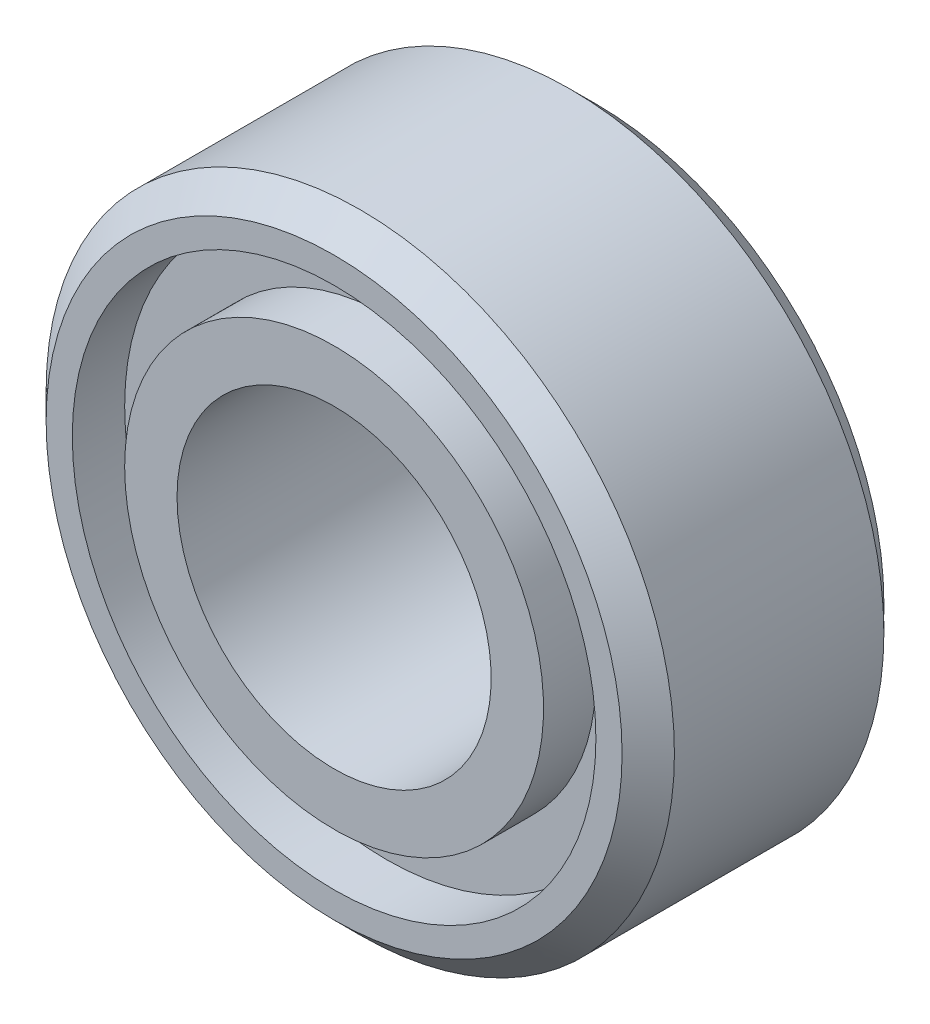
ISO-10303-21;
HEADER;
FILE_DESCRIPTION(('STEP AP214'),'2;1');
FILE_NAME('part.step','',(''),(''),'','','');
FILE_SCHEMA(('AUTOMOTIVE_DESIGN { 1 0 10303 214 1 1 1 1 }'));
ENDSEC;
DATA;
#1=APPLICATION_CONTEXT('core data for automotive mechanical design processes');
#2=APPLICATION_PROTOCOL_DEFINITION('international standard','automotive_design',2000,#1);
#3=PRODUCT_CONTEXT('',#1,'mechanical');
#4=PRODUCT('Part','Part','',(#3));
#5=PRODUCT_RELATED_PRODUCT_CATEGORY('part','',(#4));
#6=PRODUCT_DEFINITION_FORMATION('','',#4);
#7=PRODUCT_DEFINITION_CONTEXT('part definition',#1,'design');
#8=PRODUCT_DEFINITION('design','',#6,#7);
#9=PRODUCT_DEFINITION_SHAPE('','',#8);
#10=(LENGTH_UNIT() NAMED_UNIT(*) SI_UNIT(.MILLI.,.METRE.));
#11=(NAMED_UNIT(*) PLANE_ANGLE_UNIT() SI_UNIT($,.RADIAN.));
#12=(NAMED_UNIT(*) SI_UNIT($,.STERADIAN.) SOLID_ANGLE_UNIT());
#13=UNCERTAINTY_MEASURE_WITH_UNIT(LENGTH_MEASURE(1.E-05),#10,'distance_accuracy_value','');
#14=(GEOMETRIC_REPRESENTATION_CONTEXT(3) GLOBAL_UNCERTAINTY_ASSIGNED_CONTEXT((#13)) GLOBAL_UNIT_ASSIGNED_CONTEXT((#10,
#11,#12)) REPRESENTATION_CONTEXT('',''));
#15=CARTESIAN_POINT('',(0.,0.,0.));
#16=DIRECTION('',(0.,0.,1.));
#17=DIRECTION('',(1.,0.,0.));
#18=AXIS2_PLACEMENT_3D('',#15,#16,#17);
#19=CARTESIAN_POINT('',(0.,0.,2.5));
#20=DIRECTION('',(0.,0.,-1.));
#21=DIRECTION('',(-1.,0.,0.));
#22=AXIS2_PLACEMENT_3D('',#19,#20,#21);
#23=CYLINDRICAL_SURFACE('',#22,3.);
#24=CARTESIAN_POINT('',(0.,0.,-0.250000000000001));
#25=DIRECTION('',(0.,0.,-1.));
#26=DIRECTION('',(-1.,0.,0.));
#27=AXIS2_PLACEMENT_3D('',#24,#25,#26);
#28=CIRCLE('',#27,3.);
#29=CARTESIAN_POINT('',(-3.,0.,-0.250000000000001));
#30=VERTEX_POINT('',#29);
#31=EDGE_CURVE('E10',#30,#30,#28,.T.);
#32=ORIENTED_EDGE('',*,*,#31,.T.);
#33=EDGE_LOOP('',(#32));
#34=FACE_BOUND('',#33,.T.);
#35=CARTESIAN_POINT('',(0.,0.,-2.25));
#36=DIRECTION('',(0.,0.,-1.));
#37=DIRECTION('',(-1.,0.,0.));
#38=AXIS2_PLACEMENT_3D('',#35,#36,#37);
#39=CIRCLE('',#38,3.);
#40=CARTESIAN_POINT('',(-3.,0.,-2.25));
#41=VERTEX_POINT('',#40);
#42=EDGE_CURVE('E96',#41,#41,#39,.T.);
#43=ORIENTED_EDGE('',*,*,#42,.F.);
#44=EDGE_LOOP('',(#43));
#45=FACE_BOUND('',#44,.T.);
#46=ADVANCED_FACE('F37',(#34,#45),#23,.T.);
#47=CARTESIAN_POINT('',(0.,0.,-0.250000000000001));
#48=DIRECTION('',(0.,0.,-1.));
#49=DIRECTION('',(-1.,0.,0.));
#50=AXIS2_PLACEMENT_3D('',#47,#48,#49);
#51=CONICAL_SURFACE('',#50,3.,0.785398163397454);
#52=CARTESIAN_POINT('',(0.,0.,0.));
#53=DIRECTION('',(0.,0.,-1.));
#54=DIRECTION('',(-1.,0.,0.));
#55=AXIS2_PLACEMENT_3D('',#52,#53,#54);
#56=CIRCLE('',#55,2.75);
#57=CARTESIAN_POINT('',(-2.75,0.,0.));
#58=VERTEX_POINT('',#57);
#59=EDGE_CURVE('E44',#58,#58,#56,.T.);
#60=ORIENTED_EDGE('',*,*,#59,.T.);
#61=EDGE_LOOP('',(#60));
#62=FACE_BOUND('',#61,.T.);
#63=ORIENTED_EDGE('',*,*,#31,.F.);
#64=EDGE_LOOP('',(#63));
#65=FACE_BOUND('',#64,.T.);
#66=ADVANCED_FACE('F105',(#62,#65),#51,.T.);
#67=CARTESIAN_POINT('',(2.75,0.,0.));
#68=DIRECTION('',(0.,0.,1.));
#69=DIRECTION('',(1.,0.,0.));
#70=AXIS2_PLACEMENT_3D('',#67,#68,#69);
#71=PLANE('',#70);
#72=CARTESIAN_POINT('',(0.,0.,0.));
#73=DIRECTION('',(0.,0.,-1.));
#74=DIRECTION('',(-1.,0.,0.));
#75=AXIS2_PLACEMENT_3D('',#72,#73,#74);
#76=CIRCLE('',#75,2.5);
#77=CARTESIAN_POINT('',(-2.5,0.,0.));
#78=VERTEX_POINT('',#77);
#79=EDGE_CURVE('E49',#78,#78,#76,.T.);
#80=ORIENTED_EDGE('',*,*,#79,.T.);
#81=EDGE_LOOP('',(#80));
#82=FACE_BOUND('',#81,.T.);
#83=ORIENTED_EDGE('',*,*,#59,.F.);
#84=EDGE_LOOP('',(#83));
#85=FACE_BOUND('',#84,.T.);
#86=ADVANCED_FACE('F109',(#82,#85),#71,.T.);
#87=CARTESIAN_POINT('',(0.,0.,2.5));
#88=DIRECTION('',(0.,0.,-1.));
#89=DIRECTION('',(-1.,0.,0.));
#90=AXIS2_PLACEMENT_3D('',#87,#88,#89);
#91=CYLINDRICAL_SURFACE('',#90,2.5);
#92=CARTESIAN_POINT('',(0.,0.,-0.499999999999999));
#93=DIRECTION('',(0.,0.,-1.));
#94=DIRECTION('',(-1.,0.,0.));
#95=AXIS2_PLACEMENT_3D('',#92,#93,#94);
#96=CIRCLE('',#95,2.5);
#97=CARTESIAN_POINT('',(-2.5,0.,-0.499999999999999));
#98=VERTEX_POINT('',#97);
#99=EDGE_CURVE('E54',#98,#98,#96,.T.);
#100=ORIENTED_EDGE('',*,*,#99,.T.);
#101=EDGE_LOOP('',(#100));
#102=FACE_BOUND('',#101,.T.);
#103=ORIENTED_EDGE('',*,*,#79,.F.);
#104=EDGE_LOOP('',(#103));
#105=FACE_BOUND('',#104,.T.);
#106=ADVANCED_FACE('F113',(#102,#105),#91,.F.);
#107=CARTESIAN_POINT('',(2.5,0.,-0.499999999999999));
#108=DIRECTION('',(0.,0.,1.));
#109=DIRECTION('',(1.,0.,0.));
#110=AXIS2_PLACEMENT_3D('',#107,#108,#109);
#111=PLANE('',#110);
#112=CARTESIAN_POINT('',(0.,0.,-0.499999999999999));
#113=DIRECTION('',(0.,0.,-1.));
#114=DIRECTION('',(-1.,0.,0.));
#115=AXIS2_PLACEMENT_3D('',#112,#113,#114);
#116=CIRCLE('',#115,2.);
#117=CARTESIAN_POINT('',(-2.,0.,-0.499999999999999));
#118=VERTEX_POINT('',#117);
#119=EDGE_CURVE('E60',#118,#118,#116,.T.);
#120=ORIENTED_EDGE('',*,*,#119,.T.);
#121=EDGE_LOOP('',(#120));
#122=FACE_BOUND('',#121,.T.);
#123=ORIENTED_EDGE('',*,*,#99,.F.);
#124=EDGE_LOOP('',(#123));
#125=FACE_BOUND('',#124,.T.);
#126=ADVANCED_FACE('F120',(#122,#125),#111,.T.);
#127=CARTESIAN_POINT('',(0.,0.,2.5));
#128=DIRECTION('',(0.,0.,-1.));
#129=DIRECTION('',(-1.,0.,0.));
#130=AXIS2_PLACEMENT_3D('',#127,#128,#129);
#131=CYLINDRICAL_SURFACE('',#130,2.);
#132=CARTESIAN_POINT('',(0.,0.,0.));
#133=DIRECTION('',(0.,0.,-1.));
#134=DIRECTION('',(-1.,0.,0.));
#135=AXIS2_PLACEMENT_3D('',#132,#133,#134);
#136=CIRCLE('',#135,2.);
#137=CARTESIAN_POINT('',(-2.,0.,0.));
#138=VERTEX_POINT('',#137);
#139=EDGE_CURVE('E64',#138,#138,#136,.T.);
#140=ORIENTED_EDGE('',*,*,#139,.T.);
#141=EDGE_LOOP('',(#140));
#142=FACE_BOUND('',#141,.T.);
#143=ORIENTED_EDGE('',*,*,#119,.F.);
#144=EDGE_LOOP('',(#143));
#145=FACE_BOUND('',#144,.T.);
#146=ADVANCED_FACE('F124',(#142,#145),#131,.T.);
#147=CARTESIAN_POINT('',(2.,0.,0.));
#148=DIRECTION('',(0.,0.,1.));
#149=DIRECTION('',(1.,0.,0.));
#150=AXIS2_PLACEMENT_3D('',#147,#148,#149);
#151=PLANE('',#150);
#152=CARTESIAN_POINT('',(0.,0.,0.));
#153=DIRECTION('',(0.,0.,-1.));
#154=DIRECTION('',(-1.,0.,0.));
#155=AXIS2_PLACEMENT_3D('',#152,#153,#154);
#156=CIRCLE('',#155,1.5);
#157=CARTESIAN_POINT('',(-1.5,0.,0.));
#158=VERTEX_POINT('',#157);
#159=EDGE_CURVE('E68',#158,#158,#156,.T.);
#160=ORIENTED_EDGE('',*,*,#159,.T.);
#161=EDGE_LOOP('',(#160));
#162=FACE_BOUND('',#161,.T.);
#163=ORIENTED_EDGE('',*,*,#139,.F.);
#164=EDGE_LOOP('',(#163));
#165=FACE_BOUND('',#164,.T.);
#166=ADVANCED_FACE('F128',(#162,#165),#151,.T.);
#167=CARTESIAN_POINT('',(0.,0.,2.5));
#168=DIRECTION('',(0.,0.,-1.));
#169=DIRECTION('',(-1.,0.,0.));
#170=AXIS2_PLACEMENT_3D('',#167,#168,#169);
#171=CYLINDRICAL_SURFACE('',#170,1.5);
#172=CARTESIAN_POINT('',(0.,0.,-2.5));
#173=DIRECTION('',(0.,0.,-1.));
#174=DIRECTION('',(-1.,0.,0.));
#175=AXIS2_PLACEMENT_3D('',#172,#173,#174);
#176=CIRCLE('',#175,1.5);
#177=CARTESIAN_POINT('',(-1.5,0.,-2.5));
#178=VERTEX_POINT('',#177);
#179=EDGE_CURVE('E72',#178,#178,#176,.T.);
#180=ORIENTED_EDGE('',*,*,#179,.T.);
#181=EDGE_LOOP('',(#180));
#182=FACE_BOUND('',#181,.T.);
#183=ORIENTED_EDGE('',*,*,#159,.F.);
#184=EDGE_LOOP('',(#183));
#185=FACE_BOUND('',#184,.T.);
#186=ADVANCED_FACE('F132',(#182,#185),#171,.F.);
#187=CARTESIAN_POINT('',(1.5,0.,-2.5));
#188=DIRECTION('',(0.,0.,-1.));
#189=DIRECTION('',(-1.,0.,0.));
#190=AXIS2_PLACEMENT_3D('',#187,#188,#189);
#191=PLANE('',#190);
#192=CARTESIAN_POINT('',(0.,0.,-2.5));
#193=DIRECTION('',(0.,0.,-1.));
#194=DIRECTION('',(-1.,0.,0.));
#195=AXIS2_PLACEMENT_3D('',#192,#193,#194);
#196=CIRCLE('',#195,2.);
#197=CARTESIAN_POINT('',(-2.,0.,-2.5));
#198=VERTEX_POINT('',#197);
#199=EDGE_CURVE('E76',#198,#198,#196,.T.);
#200=ORIENTED_EDGE('',*,*,#199,.T.);
#201=EDGE_LOOP('',(#200));
#202=FACE_BOUND('',#201,.T.);
#203=ORIENTED_EDGE('',*,*,#179,.F.);
#204=EDGE_LOOP('',(#203));
#205=FACE_BOUND('',#204,.T.);
#206=ADVANCED_FACE('F136',(#202,#205),#191,.T.);
#207=CARTESIAN_POINT('',(0.,0.,2.5));
#208=DIRECTION('',(0.,0.,-1.));
#209=DIRECTION('',(-1.,0.,0.));
#210=AXIS2_PLACEMENT_3D('',#207,#208,#209);
#211=CYLINDRICAL_SURFACE('',#210,2.);
#212=CARTESIAN_POINT('',(0.,0.,-2.));
#213=DIRECTION('',(0.,0.,-1.));
#214=DIRECTION('',(-1.,0.,0.));
#215=AXIS2_PLACEMENT_3D('',#212,#213,#214);
#216=CIRCLE('',#215,2.);
#217=CARTESIAN_POINT('',(-2.,0.,-2.));
#218=VERTEX_POINT('',#217);
#219=EDGE_CURVE('E80',#218,#218,#216,.T.);
#220=ORIENTED_EDGE('',*,*,#219,.T.);
#221=EDGE_LOOP('',(#220));
#222=FACE_BOUND('',#221,.T.);
#223=ORIENTED_EDGE('',*,*,#199,.F.);
#224=EDGE_LOOP('',(#223));
#225=FACE_BOUND('',#224,.T.);
#226=ADVANCED_FACE('F140',(#222,#225),#211,.T.);
#227=CARTESIAN_POINT('',(2.,0.,-2.));
#228=DIRECTION('',(0.,0.,-1.));
#229=DIRECTION('',(-1.,0.,0.));
#230=AXIS2_PLACEMENT_3D('',#227,#228,#229);
#231=PLANE('',#230);
#232=CARTESIAN_POINT('',(0.,0.,-2.));
#233=DIRECTION('',(0.,0.,-1.));
#234=DIRECTION('',(-1.,0.,0.));
#235=AXIS2_PLACEMENT_3D('',#232,#233,#234);
#236=CIRCLE('',#235,2.5);
#237=CARTESIAN_POINT('',(-2.5,0.,-2.));
#238=VERTEX_POINT('',#237);
#239=EDGE_CURVE('E84',#238,#238,#236,.T.);
#240=ORIENTED_EDGE('',*,*,#239,.T.);
#241=EDGE_LOOP('',(#240));
#242=FACE_BOUND('',#241,.T.);
#243=ORIENTED_EDGE('',*,*,#219,.F.);
#244=EDGE_LOOP('',(#243));
#245=FACE_BOUND('',#244,.T.);
#246=ADVANCED_FACE('F144',(#242,#245),#231,.T.);
#247=CARTESIAN_POINT('',(0.,0.,2.5));
#248=DIRECTION('',(0.,0.,-1.));
#249=DIRECTION('',(-1.,0.,0.));
#250=AXIS2_PLACEMENT_3D('',#247,#248,#249);
#251=CYLINDRICAL_SURFACE('',#250,2.5);
#252=CARTESIAN_POINT('',(0.,0.,-2.5));
#253=DIRECTION('',(0.,0.,-1.));
#254=DIRECTION('',(-1.,0.,0.));
#255=AXIS2_PLACEMENT_3D('',#252,#253,#254);
#256=CIRCLE('',#255,2.5);
#257=CARTESIAN_POINT('',(-2.5,0.,-2.5));
#258=VERTEX_POINT('',#257);
#259=EDGE_CURVE('E88',#258,#258,#256,.T.);
#260=ORIENTED_EDGE('',*,*,#259,.T.);
#261=EDGE_LOOP('',(#260));
#262=FACE_BOUND('',#261,.T.);
#263=ORIENTED_EDGE('',*,*,#239,.F.);
#264=EDGE_LOOP('',(#263));
#265=FACE_BOUND('',#264,.T.);
#266=ADVANCED_FACE('F148',(#262,#265),#251,.F.);
#267=CARTESIAN_POINT('',(2.5,0.,-2.5));
#268=DIRECTION('',(0.,0.,-1.));
#269=DIRECTION('',(-1.,0.,0.));
#270=AXIS2_PLACEMENT_3D('',#267,#268,#269);
#271=PLANE('',#270);
#272=CARTESIAN_POINT('',(0.,0.,-2.5));
#273=DIRECTION('',(0.,0.,-1.));
#274=DIRECTION('',(-1.,0.,0.));
#275=AXIS2_PLACEMENT_3D('',#272,#273,#274);
#276=CIRCLE('',#275,2.74999999999999);
#277=CARTESIAN_POINT('',(-2.74999999999999,0.,-2.5));
#278=VERTEX_POINT('',#277);
#279=EDGE_CURVE('E92',#278,#278,#276,.T.);
#280=ORIENTED_EDGE('',*,*,#279,.T.);
#281=EDGE_LOOP('',(#280));
#282=FACE_BOUND('',#281,.T.);
#283=ORIENTED_EDGE('',*,*,#259,.F.);
#284=EDGE_LOOP('',(#283));
#285=FACE_BOUND('',#284,.T.);
#286=ADVANCED_FACE('F152',(#282,#285),#271,.T.);
#287=CARTESIAN_POINT('',(0.,0.,-2.5));
#288=DIRECTION('',(0.,0.,1.));
#289=DIRECTION('',(1.,0.,0.));
#290=AXIS2_PLACEMENT_3D('',#287,#288,#289);
#291=CONICAL_SURFACE('',#290,2.74999999999999,0.785398163397453);
#292=ORIENTED_EDGE('',*,*,#42,.T.);
#293=EDGE_LOOP('',(#292));
#294=FACE_BOUND('',#293,.T.);
#295=ORIENTED_EDGE('',*,*,#279,.F.);
#296=EDGE_LOOP('',(#295));
#297=FACE_BOUND('',#296,.T.);
#298=ADVANCED_FACE('F101',(#294,#297),#291,.T.);
#299=CLOSED_SHELL('',(#46,#66,#86,#106,#126,#146,#166,#186,#206,#226,#246,#266,#286,#298));
#300=MANIFOLD_SOLID_BREP('B2',#299);
#301=ADVANCED_BREP_SHAPE_REPRESENTATION('',(#18,#300),#14);
#302=SHAPE_DEFINITION_REPRESENTATION(#9,#301);
ENDSEC;
END-ISO-10303-21;
